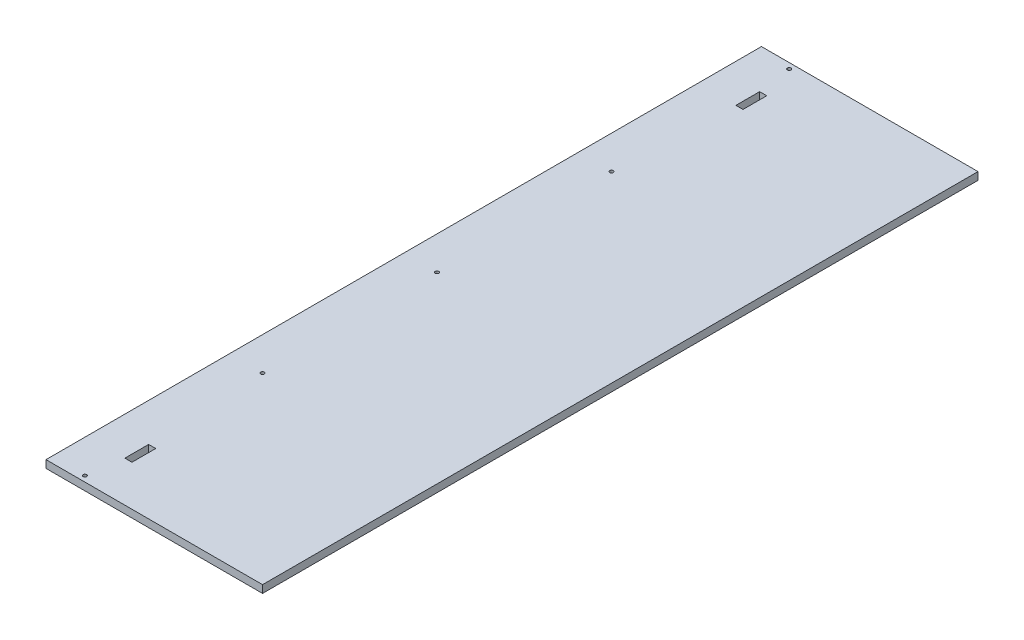
ISO-10303-21;
HEADER;
FILE_DESCRIPTION(('STEP AP214'),'2;1');
FILE_NAME('part.step','',(''),(''),'','','');
FILE_SCHEMA(('AUTOMOTIVE_DESIGN { 1 0 10303 214 1 1 1 1 }'));
ENDSEC;
DATA;
#1=APPLICATION_CONTEXT('core data for automotive mechanical design processes');
#2=APPLICATION_PROTOCOL_DEFINITION('international standard','automotive_design',2000,#1);
#3=PRODUCT_CONTEXT('',#1,'mechanical');
#4=PRODUCT('Part','Part','',(#3));
#5=PRODUCT_RELATED_PRODUCT_CATEGORY('part','',(#4));
#6=PRODUCT_DEFINITION_FORMATION('','',#4);
#7=PRODUCT_DEFINITION_CONTEXT('part definition',#1,'design');
#8=PRODUCT_DEFINITION('design','',#6,#7);
#9=PRODUCT_DEFINITION_SHAPE('','',#8);
#10=(LENGTH_UNIT() NAMED_UNIT(*) SI_UNIT(.MILLI.,.METRE.));
#11=(NAMED_UNIT(*) PLANE_ANGLE_UNIT() SI_UNIT($,.RADIAN.));
#12=(NAMED_UNIT(*) SI_UNIT($,.STERADIAN.) SOLID_ANGLE_UNIT());
#13=UNCERTAINTY_MEASURE_WITH_UNIT(LENGTH_MEASURE(1.E-05),#10,'distance_accuracy_value','');
#14=(GEOMETRIC_REPRESENTATION_CONTEXT(3) GLOBAL_UNCERTAINTY_ASSIGNED_CONTEXT((#13)) GLOBAL_UNIT_ASSIGNED_CONTEXT((#10,
#11,#12)) REPRESENTATION_CONTEXT('',''));
#15=CARTESIAN_POINT('',(0.,0.,0.));
#16=DIRECTION('',(0.,0.,1.));
#17=DIRECTION('',(1.,0.,0.));
#18=AXIS2_PLACEMENT_3D('',#15,#16,#17);
#19=CARTESIAN_POINT('',(-50.0000000000001,13.,-609.6));
#20=DIRECTION('',(0.,0.,1.));
#21=DIRECTION('',(1.,0.,0.));
#22=AXIS2_PLACEMENT_3D('',#19,#20,#21);
#23=PLANE('',#22);
#24=DIRECTION('',(0.,-1.,0.));
#25=VECTOR('',#24,1.);
#26=CARTESIAN_POINT('',(-50.0000000000001,13.,-609.6));
#27=LINE('',#26,#25);
#28=CARTESIAN_POINT('',(-50.0000000000001,13.,-609.6));
#29=VERTEX_POINT('',#28);
#30=CARTESIAN_POINT('',(-50.0000000000001,0.,-609.6));
#31=VERTEX_POINT('',#30);
#32=EDGE_CURVE('E217',#29,#31,#27,.T.);
#33=ORIENTED_EDGE('',*,*,#32,.F.);
#34=DIRECTION('',(-1.,0.,0.));
#35=VECTOR('',#34,1.);
#36=CARTESIAN_POINT('',(-50.0000000000001,13.,-609.6));
#37=LINE('',#36,#35);
#38=CARTESIAN_POINT('',(319.,13.,-609.6));
#39=VERTEX_POINT('',#38);
#40=EDGE_CURVE('E202',#39,#29,#37,.T.);
#41=ORIENTED_EDGE('',*,*,#40,.F.);
#42=DIRECTION('',(0.,-1.,0.));
#43=VECTOR('',#42,1.);
#44=CARTESIAN_POINT('',(319.,13.,-609.6));
#45=LINE('',#44,#43);
#46=CARTESIAN_POINT('',(319.,0.,-609.6));
#47=VERTEX_POINT('',#46);
#48=EDGE_CURVE('E171',#39,#47,#45,.T.);
#49=ORIENTED_EDGE('',*,*,#48,.T.);
#50=DIRECTION('',(-1.,0.,0.));
#51=VECTOR('',#50,1.);
#52=CARTESIAN_POINT('',(-50.0000000000001,0.,-609.6));
#53=LINE('',#52,#51);
#54=EDGE_CURVE('E210',#47,#31,#53,.T.);
#55=ORIENTED_EDGE('',*,*,#54,.T.);
#56=EDGE_LOOP('',(#33,#41,#49,#55));
#57=FACE_BOUND('',#56,.T.);
#58=ADVANCED_FACE('F34',(#57),#23,.F.);
#59=CARTESIAN_POINT('',(-50.0000000000001,13.,-609.6));
#60=DIRECTION('',(1.,0.,0.));
#61=DIRECTION('',(0.,0.,-1.));
#62=AXIS2_PLACEMENT_3D('',#59,#60,#61);
#63=PLANE('',#62);
#64=DIRECTION('',(0.,0.,1.));
#65=VECTOR('',#64,1.);
#66=CARTESIAN_POINT('',(-50.0000000000001,0.,-609.6));
#67=LINE('',#66,#65);
#68=CARTESIAN_POINT('',(-49.9999999999999,0.,609.6));
#69=VERTEX_POINT('',#68);
#70=EDGE_CURVE('E212',#31,#69,#67,.T.);
#71=ORIENTED_EDGE('',*,*,#70,.T.);
#72=DIRECTION('',(0.,-1.,0.));
#73=VECTOR('',#72,1.);
#74=CARTESIAN_POINT('',(-49.9999999999999,13.,609.6));
#75=LINE('',#74,#73);
#76=CARTESIAN_POINT('',(-49.9999999999999,13.,609.6));
#77=VERTEX_POINT('',#76);
#78=EDGE_CURVE('E209',#77,#69,#75,.T.);
#79=ORIENTED_EDGE('',*,*,#78,.F.);
#80=DIRECTION('',(0.,0.,1.));
#81=VECTOR('',#80,1.);
#82=CARTESIAN_POINT('',(-50.0000000000001,13.,-609.6));
#83=LINE('',#82,#81);
#84=EDGE_CURVE('E204',#29,#77,#83,.T.);
#85=ORIENTED_EDGE('',*,*,#84,.F.);
#86=ORIENTED_EDGE('',*,*,#32,.T.);
#87=EDGE_LOOP('',(#71,#79,#85,#86));
#88=FACE_BOUND('',#87,.T.);
#89=ADVANCED_FACE('F266',(#88),#63,.F.);
#90=CARTESIAN_POINT('',(-49.9999999999999,13.,609.6));
#91=DIRECTION('',(0.,0.,-1.));
#92=DIRECTION('',(-1.,0.,0.));
#93=AXIS2_PLACEMENT_3D('',#90,#91,#92);
#94=PLANE('',#93);
#95=DIRECTION('',(1.,0.,0.));
#96=VECTOR('',#95,1.);
#97=CARTESIAN_POINT('',(-49.9999999999999,0.,609.6));
#98=LINE('',#97,#96);
#99=CARTESIAN_POINT('',(319.,0.,609.6));
#100=VERTEX_POINT('',#99);
#101=EDGE_CURVE('E205',#69,#100,#98,.T.);
#102=ORIENTED_EDGE('',*,*,#101,.T.);
#103=DIRECTION('',(0.,1.,0.));
#104=VECTOR('',#103,1.);
#105=CARTESIAN_POINT('',(319.,13.,609.6));
#106=LINE('',#105,#104);
#107=CARTESIAN_POINT('',(319.,13.,609.6));
#108=VERTEX_POINT('',#107);
#109=EDGE_CURVE('E164',#100,#108,#106,.T.);
#110=ORIENTED_EDGE('',*,*,#109,.T.);
#111=DIRECTION('',(1.,0.,0.));
#112=VECTOR('',#111,1.);
#113=CARTESIAN_POINT('',(-49.9999999999999,13.,609.6));
#114=LINE('',#113,#112);
#115=EDGE_CURVE('E207',#77,#108,#114,.T.);
#116=ORIENTED_EDGE('',*,*,#115,.F.);
#117=ORIENTED_EDGE('',*,*,#78,.T.);
#118=EDGE_LOOP('',(#102,#110,#116,#117));
#119=FACE_BOUND('',#118,.T.);
#120=ADVANCED_FACE('F271',(#119),#94,.F.);
#121=CARTESIAN_POINT('',(50.0000000000001,13.,609.6));
#122=DIRECTION('',(0.,1.,0.));
#123=DIRECTION('',(0.,0.,1.));
#124=AXIS2_PLACEMENT_3D('',#121,#122,#123);
#125=PLANE('',#124);
#126=DIRECTION('',(0.,0.,1.));
#127=VECTOR('',#126,1.);
#128=CARTESIAN_POINT('',(14.9999999999997,13.,-541.53));
#129=LINE('',#128,#127);
#130=CARTESIAN_POINT('',(14.9999999999997,13.,-541.53));
#131=VERTEX_POINT('',#130);
#132=CARTESIAN_POINT('',(14.9999999999997,13.,-501.03));
#133=VERTEX_POINT('',#132);
#134=EDGE_CURVE('E48',#131,#133,#129,.T.);
#135=ORIENTED_EDGE('',*,*,#134,.F.);
#136=DIRECTION('',(-1.,0.,0.));
#137=VECTOR('',#136,1.);
#138=CARTESIAN_POINT('',(14.9999999999997,13.,-541.53));
#139=LINE('',#138,#137);
#140=CARTESIAN_POINT('',(27.0999999999997,13.,-541.53));
#141=VERTEX_POINT('',#140);
#142=EDGE_CURVE('E141',#141,#131,#139,.T.);
#143=ORIENTED_EDGE('',*,*,#142,.F.);
#144=DIRECTION('',(0.,0.,-1.));
#145=VECTOR('',#144,1.);
#146=CARTESIAN_POINT('',(27.0999999999997,13.,-541.53));
#147=LINE('',#146,#145);
#148=CARTESIAN_POINT('',(27.0999999999997,13.,-501.03));
#149=VERTEX_POINT('',#148);
#150=EDGE_CURVE('E125',#149,#141,#147,.T.);
#151=ORIENTED_EDGE('',*,*,#150,.F.);
#152=DIRECTION('',(1.,0.,0.));
#153=VECTOR('',#152,1.);
#154=CARTESIAN_POINT('',(14.9999999999997,13.,-501.03));
#155=LINE('',#154,#153);
#156=EDGE_CURVE('E134',#133,#149,#155,.T.);
#157=ORIENTED_EDGE('',*,*,#156,.F.);
#158=EDGE_LOOP('',(#135,#143,#151,#157));
#159=FACE_BOUND('',#158,.T.);
#160=DIRECTION('',(0.,0.,1.));
#161=VECTOR('',#160,1.);
#162=CARTESIAN_POINT('',(14.9999999999999,13.,499.72));
#163=LINE('',#162,#161);
#164=CARTESIAN_POINT('',(14.9999999999999,13.,499.72));
#165=VERTEX_POINT('',#164);
#166=CARTESIAN_POINT('',(14.9999999999999,13.,540.22));
#167=VERTEX_POINT('',#166);
#168=EDGE_CURVE('E148',#165,#167,#163,.T.);
#169=ORIENTED_EDGE('',*,*,#168,.F.);
#170=DIRECTION('',(-1.,0.,0.));
#171=VECTOR('',#170,1.);
#172=CARTESIAN_POINT('',(14.9999999999999,13.,499.72));
#173=LINE('',#172,#171);
#174=CARTESIAN_POINT('',(27.0999999999999,13.,499.72));
#175=VERTEX_POINT('',#174);
#176=EDGE_CURVE('E158',#175,#165,#173,.T.);
#177=ORIENTED_EDGE('',*,*,#176,.F.);
#178=DIRECTION('',(0.,0.,-1.));
#179=VECTOR('',#178,1.);
#180=CARTESIAN_POINT('',(27.0999999999999,13.,499.72));
#181=LINE('',#180,#179);
#182=CARTESIAN_POINT('',(27.0999999999999,13.,540.22));
#183=VERTEX_POINT('',#182);
#184=EDGE_CURVE('E155',#183,#175,#181,.T.);
#185=ORIENTED_EDGE('',*,*,#184,.F.);
#186=DIRECTION('',(1.,0.,0.));
#187=VECTOR('',#186,1.);
#188=CARTESIAN_POINT('',(14.9999999999999,13.,540.22));
#189=LINE('',#188,#187);
#190=EDGE_CURVE('E152',#167,#183,#189,.T.);
#191=ORIENTED_EDGE('',*,*,#190,.F.);
#192=EDGE_LOOP('',(#169,#177,#185,#191));
#193=FACE_BOUND('',#192,.T.);
#194=ORIENTED_EDGE('',*,*,#115,.T.);
#195=DIRECTION('',(0.,0.,1.));
#196=VECTOR('',#195,1.);
#197=CARTESIAN_POINT('',(319.,13.,-889.637672886696));
#198=LINE('',#197,#196);
#199=EDGE_CURVE('E175',#39,#108,#198,.T.);
#200=ORIENTED_EDGE('',*,*,#199,.F.);
#201=ORIENTED_EDGE('',*,*,#40,.T.);
#202=ORIENTED_EDGE('',*,*,#84,.T.);
#203=EDGE_LOOP('',(#194,#200,#201,#202));
#204=FACE_BOUND('',#203,.T.);
#205=CARTESIAN_POINT('',(6.74296906188358,13.,-600.1));
#206=DIRECTION('',(0.,1.,0.));
#207=DIRECTION('',(0.,0.,1.));
#208=AXIS2_PLACEMENT_3D('',#205,#206,#207);
#209=CIRCLE('',#208,3.);
#210=CARTESIAN_POINT('',(6.74296906188358,13.,-597.1));
#211=VERTEX_POINT('',#210);
#212=EDGE_CURVE('E174',#211,#211,#209,.T.);
#213=ORIENTED_EDGE('',*,*,#212,.F.);
#214=EDGE_LOOP('',(#213));
#215=FACE_BOUND('',#214,.T.);
#216=CARTESIAN_POINT('',(6.74296906188416,13.,-297.3));
#217=DIRECTION('',(0.,1.,0.));
#218=DIRECTION('',(0.,0.,1.));
#219=AXIS2_PLACEMENT_3D('',#216,#217,#218);
#220=CIRCLE('',#219,3.);
#221=CARTESIAN_POINT('',(6.74296906188416,13.,-294.3));
#222=VERTEX_POINT('',#221);
#223=EDGE_CURVE('E186',#222,#222,#220,.T.);
#224=ORIENTED_EDGE('',*,*,#223,.F.);
#225=EDGE_LOOP('',(#224));
#226=FACE_BOUND('',#225,.T.);
#227=CARTESIAN_POINT('',(6.74296906188408,13.,-2.22044604925031E-13));
#228=DIRECTION('',(0.,1.,0.));
#229=DIRECTION('',(0.,0.,1.));
#230=AXIS2_PLACEMENT_3D('',#227,#228,#229);
#231=CIRCLE('',#230,3.);
#232=CARTESIAN_POINT('',(6.74296906188408,13.,2.99999999999978));
#233=VERTEX_POINT('',#232);
#234=EDGE_CURVE('E190',#233,#233,#231,.T.);
#235=ORIENTED_EDGE('',*,*,#234,.F.);
#236=EDGE_LOOP('',(#235));
#237=FACE_BOUND('',#236,.T.);
#238=CARTESIAN_POINT('',(6.74296906188433,13.,297.3));
#239=DIRECTION('',(0.,1.,0.));
#240=DIRECTION('',(0.,0.,1.));
#241=AXIS2_PLACEMENT_3D('',#238,#239,#240);
#242=CIRCLE('',#241,3.);
#243=CARTESIAN_POINT('',(6.74296906188433,13.,300.3));
#244=VERTEX_POINT('',#243);
#245=EDGE_CURVE('E194',#244,#244,#242,.T.);
#246=ORIENTED_EDGE('',*,*,#245,.F.);
#247=EDGE_LOOP('',(#246));
#248=FACE_BOUND('',#247,.T.);
#249=CARTESIAN_POINT('',(6.74296906188521,13.,600.1));
#250=DIRECTION('',(0.,1.,0.));
#251=DIRECTION('',(0.,0.,1.));
#252=AXIS2_PLACEMENT_3D('',#249,#250,#251);
#253=CIRCLE('',#252,3.);
#254=CARTESIAN_POINT('',(6.74296906188521,13.,603.1));
#255=VERTEX_POINT('',#254);
#256=EDGE_CURVE('E198',#255,#255,#253,.T.);
#257=ORIENTED_EDGE('',*,*,#256,.F.);
#258=EDGE_LOOP('',(#257));
#259=FACE_BOUND('',#258,.T.);
#260=ADVANCED_FACE('F138',(#159,#193,#204,#215,#226,#237,#248,#259),#125,.T.);
#261=CARTESIAN_POINT('',(50.0000000000001,0.,609.6));
#262=DIRECTION('',(0.,1.,0.));
#263=DIRECTION('',(0.,0.,1.));
#264=AXIS2_PLACEMENT_3D('',#261,#262,#263);
#265=PLANE('',#264);
#266=DIRECTION('',(-1.,0.,0.));
#267=VECTOR('',#266,1.);
#268=CARTESIAN_POINT('',(50.0000000000001,0.,-541.53));
#269=LINE('',#268,#267);
#270=CARTESIAN_POINT('',(27.0999999999997,0.,-541.53));
#271=VERTEX_POINT('',#270);
#272=CARTESIAN_POINT('',(14.9999999999997,0.,-541.53));
#273=VERTEX_POINT('',#272);
#274=EDGE_CURVE('E41',#271,#273,#269,.T.);
#275=ORIENTED_EDGE('',*,*,#274,.T.);
#276=DIRECTION('',(0.,0.,1.));
#277=VECTOR('',#276,1.);
#278=CARTESIAN_POINT('',(14.9999999999999,0.,609.6));
#279=LINE('',#278,#277);
#280=CARTESIAN_POINT('',(14.9999999999997,0.,-501.03));
#281=VERTEX_POINT('',#280);
#282=EDGE_CURVE('E11',#273,#281,#279,.T.);
#283=ORIENTED_EDGE('',*,*,#282,.T.);
#284=DIRECTION('',(1.,0.,0.));
#285=VECTOR('',#284,1.);
#286=CARTESIAN_POINT('',(50.0000000000001,0.,-501.03));
#287=LINE('',#286,#285);
#288=CARTESIAN_POINT('',(27.0999999999997,0.,-501.03));
#289=VERTEX_POINT('',#288);
#290=EDGE_CURVE('E242',#281,#289,#287,.T.);
#291=ORIENTED_EDGE('',*,*,#290,.T.);
#292=DIRECTION('',(0.,0.,-1.));
#293=VECTOR('',#292,1.);
#294=CARTESIAN_POINT('',(27.0999999999999,0.,609.6));
#295=LINE('',#294,#293);
#296=EDGE_CURVE('E128',#289,#271,#295,.T.);
#297=ORIENTED_EDGE('',*,*,#296,.T.);
#298=EDGE_LOOP('',(#275,#283,#291,#297));
#299=FACE_BOUND('',#298,.T.);
#300=DIRECTION('',(-1.,0.,0.));
#301=VECTOR('',#300,1.);
#302=CARTESIAN_POINT('',(50.0000000000001,0.,499.72));
#303=LINE('',#302,#301);
#304=CARTESIAN_POINT('',(27.0999999999999,0.,499.72));
#305=VERTEX_POINT('',#304);
#306=CARTESIAN_POINT('',(14.9999999999999,0.,499.72));
#307=VERTEX_POINT('',#306);
#308=EDGE_CURVE('E236',#305,#307,#303,.T.);
#309=ORIENTED_EDGE('',*,*,#308,.T.);
#310=DIRECTION('',(0.,0.,1.));
#311=VECTOR('',#310,1.);
#312=CARTESIAN_POINT('',(15.,0.,609.6));
#313=LINE('',#312,#311);
#314=CARTESIAN_POINT('',(14.9999999999999,0.,540.22));
#315=VERTEX_POINT('',#314);
#316=EDGE_CURVE('E239',#307,#315,#313,.T.);
#317=ORIENTED_EDGE('',*,*,#316,.T.);
#318=DIRECTION('',(1.,0.,0.));
#319=VECTOR('',#318,1.);
#320=CARTESIAN_POINT('',(50.0000000000001,0.,540.22));
#321=LINE('',#320,#319);
#322=CARTESIAN_POINT('',(27.0999999999999,0.,540.22));
#323=VERTEX_POINT('',#322);
#324=EDGE_CURVE('E220',#315,#323,#321,.T.);
#325=ORIENTED_EDGE('',*,*,#324,.T.);
#326=DIRECTION('',(0.,0.,-1.));
#327=VECTOR('',#326,1.);
#328=CARTESIAN_POINT('',(27.0999999999999,0.,609.6));
#329=LINE('',#328,#327);
#330=EDGE_CURVE('E233',#323,#305,#329,.T.);
#331=ORIENTED_EDGE('',*,*,#330,.T.);
#332=EDGE_LOOP('',(#309,#317,#325,#331));
#333=FACE_BOUND('',#332,.T.);
#334=CARTESIAN_POINT('',(6.74296906188358,0.,-600.1));
#335=DIRECTION('',(0.,1.,0.));
#336=DIRECTION('',(0.,0.,1.));
#337=AXIS2_PLACEMENT_3D('',#334,#335,#336);
#338=CIRCLE('',#337,3.);
#339=CARTESIAN_POINT('',(6.74296906188358,0.,-597.1));
#340=VERTEX_POINT('',#339);
#341=EDGE_CURVE('E185',#340,#340,#338,.T.);
#342=ORIENTED_EDGE('',*,*,#341,.T.);
#343=EDGE_LOOP('',(#342));
#344=FACE_BOUND('',#343,.T.);
#345=CARTESIAN_POINT('',(6.74296906188416,0.,-297.3));
#346=DIRECTION('',(0.,1.,0.));
#347=DIRECTION('',(0.,0.,1.));
#348=AXIS2_PLACEMENT_3D('',#345,#346,#347);
#349=CIRCLE('',#348,3.);
#350=CARTESIAN_POINT('',(6.74296906188416,0.,-294.3));
#351=VERTEX_POINT('',#350);
#352=EDGE_CURVE('E189',#351,#351,#349,.T.);
#353=ORIENTED_EDGE('',*,*,#352,.T.);
#354=EDGE_LOOP('',(#353));
#355=FACE_BOUND('',#354,.T.);
#356=CARTESIAN_POINT('',(6.74296906188408,0.,-2.22044604925031E-13));
#357=DIRECTION('',(0.,1.,0.));
#358=DIRECTION('',(0.,0.,1.));
#359=AXIS2_PLACEMENT_3D('',#356,#357,#358);
#360=CIRCLE('',#359,3.);
#361=CARTESIAN_POINT('',(6.74296906188408,0.,2.99999999999978));
#362=VERTEX_POINT('',#361);
#363=EDGE_CURVE('E193',#362,#362,#360,.T.);
#364=ORIENTED_EDGE('',*,*,#363,.T.);
#365=EDGE_LOOP('',(#364));
#366=FACE_BOUND('',#365,.T.);
#367=CARTESIAN_POINT('',(6.74296906188433,0.,297.3));
#368=DIRECTION('',(0.,1.,0.));
#369=DIRECTION('',(0.,0.,1.));
#370=AXIS2_PLACEMENT_3D('',#367,#368,#369);
#371=CIRCLE('',#370,3.);
#372=CARTESIAN_POINT('',(6.74296906188433,0.,300.3));
#373=VERTEX_POINT('',#372);
#374=EDGE_CURVE('E197',#373,#373,#371,.T.);
#375=ORIENTED_EDGE('',*,*,#374,.T.);
#376=EDGE_LOOP('',(#375));
#377=FACE_BOUND('',#376,.T.);
#378=CARTESIAN_POINT('',(6.74296906188521,0.,600.1));
#379=DIRECTION('',(0.,1.,0.));
#380=DIRECTION('',(0.,0.,1.));
#381=AXIS2_PLACEMENT_3D('',#378,#379,#380);
#382=CIRCLE('',#381,3.);
#383=CARTESIAN_POINT('',(6.74296906188521,0.,603.1));
#384=VERTEX_POINT('',#383);
#385=EDGE_CURVE('E201',#384,#384,#382,.T.);
#386=ORIENTED_EDGE('',*,*,#385,.T.);
#387=EDGE_LOOP('',(#386));
#388=FACE_BOUND('',#387,.T.);
#389=ORIENTED_EDGE('',*,*,#70,.F.);
#390=ORIENTED_EDGE('',*,*,#54,.F.);
#391=DIRECTION('',(0.,0.,1.));
#392=VECTOR('',#391,1.);
#393=CARTESIAN_POINT('',(319.,0.,-889.637672886696));
#394=LINE('',#393,#392);
#395=EDGE_CURVE('E178',#47,#100,#394,.T.);
#396=ORIENTED_EDGE('',*,*,#395,.T.);
#397=ORIENTED_EDGE('',*,*,#101,.F.);
#398=EDGE_LOOP('',(#389,#390,#396,#397));
#399=FACE_BOUND('',#398,.T.);
#400=ADVANCED_FACE('F246',(#299,#333,#344,#355,#366,#377,#388,#399),#265,.F.);
#401=CARTESIAN_POINT('',(6.74296906188521,-7.,600.1));
#402=DIRECTION('',(0.,1.,0.));
#403=DIRECTION('',(0.,0.,1.));
#404=AXIS2_PLACEMENT_3D('',#401,#402,#403);
#405=CYLINDRICAL_SURFACE('',#404,3.);
#406=ORIENTED_EDGE('',*,*,#256,.T.);
#407=EDGE_LOOP('',(#406));
#408=FACE_BOUND('',#407,.T.);
#409=ORIENTED_EDGE('',*,*,#385,.F.);
#410=EDGE_LOOP('',(#409));
#411=FACE_BOUND('',#410,.T.);
#412=ADVANCED_FACE('F290',(#408,#411),#405,.F.);
#413=CARTESIAN_POINT('',(6.74296906188433,-7.,297.3));
#414=DIRECTION('',(0.,1.,0.));
#415=DIRECTION('',(0.,0.,1.));
#416=AXIS2_PLACEMENT_3D('',#413,#414,#415);
#417=CYLINDRICAL_SURFACE('',#416,3.);
#418=ORIENTED_EDGE('',*,*,#245,.T.);
#419=EDGE_LOOP('',(#418));
#420=FACE_BOUND('',#419,.T.);
#421=ORIENTED_EDGE('',*,*,#374,.F.);
#422=EDGE_LOOP('',(#421));
#423=FACE_BOUND('',#422,.T.);
#424=ADVANCED_FACE('F297',(#420,#423),#417,.F.);
#425=CARTESIAN_POINT('',(6.74296906188408,-7.,-2.22044604925031E-13));
#426=DIRECTION('',(0.,1.,0.));
#427=DIRECTION('',(0.,0.,1.));
#428=AXIS2_PLACEMENT_3D('',#425,#426,#427);
#429=CYLINDRICAL_SURFACE('',#428,3.);
#430=ORIENTED_EDGE('',*,*,#234,.T.);
#431=EDGE_LOOP('',(#430));
#432=FACE_BOUND('',#431,.T.);
#433=ORIENTED_EDGE('',*,*,#363,.F.);
#434=EDGE_LOOP('',(#433));
#435=FACE_BOUND('',#434,.T.);
#436=ADVANCED_FACE('F331',(#432,#435),#429,.F.);
#437=CARTESIAN_POINT('',(6.74296906188416,-7.,-297.3));
#438=DIRECTION('',(0.,1.,0.));
#439=DIRECTION('',(0.,0.,1.));
#440=AXIS2_PLACEMENT_3D('',#437,#438,#439);
#441=CYLINDRICAL_SURFACE('',#440,3.);
#442=ORIENTED_EDGE('',*,*,#223,.T.);
#443=EDGE_LOOP('',(#442));
#444=FACE_BOUND('',#443,.T.);
#445=ORIENTED_EDGE('',*,*,#352,.F.);
#446=EDGE_LOOP('',(#445));
#447=FACE_BOUND('',#446,.T.);
#448=ADVANCED_FACE('F339',(#444,#447),#441,.F.);
#449=CARTESIAN_POINT('',(6.74296906188358,-7.,-600.1));
#450=DIRECTION('',(0.,1.,0.));
#451=DIRECTION('',(0.,0.,1.));
#452=AXIS2_PLACEMENT_3D('',#449,#450,#451);
#453=CYLINDRICAL_SURFACE('',#452,3.);
#454=ORIENTED_EDGE('',*,*,#212,.T.);
#455=EDGE_LOOP('',(#454));
#456=FACE_BOUND('',#455,.T.);
#457=ORIENTED_EDGE('',*,*,#341,.F.);
#458=EDGE_LOOP('',(#457));
#459=FACE_BOUND('',#458,.T.);
#460=ADVANCED_FACE('F347',(#456,#459),#453,.F.);
#461=CARTESIAN_POINT('',(319.,13.,-889.637672886696));
#462=DIRECTION('',(1.,0.,0.));
#463=DIRECTION('',(0.,0.,-1.));
#464=AXIS2_PLACEMENT_3D('',#461,#462,#463);
#465=PLANE('',#464);
#466=ORIENTED_EDGE('',*,*,#48,.F.);
#467=ORIENTED_EDGE('',*,*,#199,.T.);
#468=ORIENTED_EDGE('',*,*,#109,.F.);
#469=ORIENTED_EDGE('',*,*,#395,.F.);
#470=EDGE_LOOP('',(#466,#467,#468,#469));
#471=FACE_BOUND('',#470,.T.);
#472=ADVANCED_FACE('F284',(#471),#465,.T.);
#473=CARTESIAN_POINT('',(14.9999999999999,-7.,499.72));
#474=DIRECTION('',(-1.,0.,0.));
#475=DIRECTION('',(0.,0.,1.));
#476=AXIS2_PLACEMENT_3D('',#473,#474,#475);
#477=PLANE('',#476);
#478=DIRECTION('',(0.,1.,0.));
#479=VECTOR('',#478,1.);
#480=CARTESIAN_POINT('',(14.9999999999999,-7.,499.72));
#481=LINE('',#480,#479);
#482=EDGE_CURVE('E162',#307,#165,#481,.T.);
#483=ORIENTED_EDGE('',*,*,#482,.T.);
#484=ORIENTED_EDGE('',*,*,#168,.T.);
#485=DIRECTION('',(0.,1.,0.));
#486=VECTOR('',#485,1.);
#487=CARTESIAN_POINT('',(14.9999999999999,-7.,540.22));
#488=LINE('',#487,#486);
#489=EDGE_CURVE('E161',#315,#167,#488,.T.);
#490=ORIENTED_EDGE('',*,*,#489,.F.);
#491=ORIENTED_EDGE('',*,*,#316,.F.);
#492=EDGE_LOOP('',(#483,#484,#490,#491));
#493=FACE_BOUND('',#492,.T.);
#494=ADVANCED_FACE('F361',(#493),#477,.F.);
#495=CARTESIAN_POINT('',(14.9999999999999,-7.,499.72));
#496=DIRECTION('',(0.,0.,-1.));
#497=DIRECTION('',(-1.,0.,0.));
#498=AXIS2_PLACEMENT_3D('',#495,#496,#497);
#499=PLANE('',#498);
#500=DIRECTION('',(0.,1.,0.));
#501=VECTOR('',#500,1.);
#502=CARTESIAN_POINT('',(27.0999999999999,-7.,499.72));
#503=LINE('',#502,#501);
#504=EDGE_CURVE('E165',#305,#175,#503,.T.);
#505=ORIENTED_EDGE('',*,*,#504,.T.);
#506=ORIENTED_EDGE('',*,*,#176,.T.);
#507=ORIENTED_EDGE('',*,*,#482,.F.);
#508=ORIENTED_EDGE('',*,*,#308,.F.);
#509=EDGE_LOOP('',(#505,#506,#507,#508));
#510=FACE_BOUND('',#509,.T.);
#511=ADVANCED_FACE('F366',(#510),#499,.F.);
#512=CARTESIAN_POINT('',(27.0999999999999,-7.,499.72));
#513=DIRECTION('',(1.,0.,0.));
#514=DIRECTION('',(0.,0.,-1.));
#515=AXIS2_PLACEMENT_3D('',#512,#513,#514);
#516=PLANE('',#515);
#517=DIRECTION('',(0.,1.,0.));
#518=VECTOR('',#517,1.);
#519=CARTESIAN_POINT('',(27.0999999999999,-7.,540.22));
#520=LINE('',#519,#518);
#521=EDGE_CURVE('E167',#323,#183,#520,.T.);
#522=ORIENTED_EDGE('',*,*,#521,.T.);
#523=ORIENTED_EDGE('',*,*,#184,.T.);
#524=ORIENTED_EDGE('',*,*,#504,.F.);
#525=ORIENTED_EDGE('',*,*,#330,.F.);
#526=EDGE_LOOP('',(#522,#523,#524,#525));
#527=FACE_BOUND('',#526,.T.);
#528=ADVANCED_FACE('F260',(#527),#516,.F.);
#529=CARTESIAN_POINT('',(14.9999999999999,-7.,540.22));
#530=DIRECTION('',(0.,0.,1.));
#531=DIRECTION('',(1.,0.,0.));
#532=AXIS2_PLACEMENT_3D('',#529,#530,#531);
#533=PLANE('',#532);
#534=ORIENTED_EDGE('',*,*,#489,.T.);
#535=ORIENTED_EDGE('',*,*,#190,.T.);
#536=ORIENTED_EDGE('',*,*,#521,.F.);
#537=ORIENTED_EDGE('',*,*,#324,.F.);
#538=EDGE_LOOP('',(#534,#535,#536,#537));
#539=FACE_BOUND('',#538,.T.);
#540=ADVANCED_FACE('F253',(#539),#533,.F.);
#541=CARTESIAN_POINT('',(14.9999999999997,-7.,-541.53));
#542=DIRECTION('',(-1.,0.,0.));
#543=DIRECTION('',(0.,0.,1.));
#544=AXIS2_PLACEMENT_3D('',#541,#542,#543);
#545=PLANE('',#544);
#546=DIRECTION('',(0.,1.,0.));
#547=VECTOR('',#546,1.);
#548=CARTESIAN_POINT('',(14.9999999999997,-7.,-541.53));
#549=LINE('',#548,#547);
#550=EDGE_CURVE('E146',#273,#131,#549,.T.);
#551=ORIENTED_EDGE('',*,*,#550,.T.);
#552=ORIENTED_EDGE('',*,*,#134,.T.);
#553=DIRECTION('',(0.,1.,0.));
#554=VECTOR('',#553,1.);
#555=CARTESIAN_POINT('',(14.9999999999997,-7.,-501.03));
#556=LINE('',#555,#554);
#557=EDGE_CURVE('E131',#281,#133,#556,.T.);
#558=ORIENTED_EDGE('',*,*,#557,.F.);
#559=ORIENTED_EDGE('',*,*,#282,.F.);
#560=EDGE_LOOP('',(#551,#552,#558,#559));
#561=FACE_BOUND('',#560,.T.);
#562=ADVANCED_FACE('F251',(#561),#545,.F.);
#563=CARTESIAN_POINT('',(14.9999999999997,-7.,-541.53));
#564=DIRECTION('',(0.,0.,-1.));
#565=DIRECTION('',(-1.,0.,0.));
#566=AXIS2_PLACEMENT_3D('',#563,#564,#565);
#567=PLANE('',#566);
#568=DIRECTION('',(0.,1.,0.));
#569=VECTOR('',#568,1.);
#570=CARTESIAN_POINT('',(27.0999999999997,-7.,-541.53));
#571=LINE('',#570,#569);
#572=EDGE_CURVE('E130',#271,#141,#571,.T.);
#573=ORIENTED_EDGE('',*,*,#572,.T.);
#574=ORIENTED_EDGE('',*,*,#142,.T.);
#575=ORIENTED_EDGE('',*,*,#550,.F.);
#576=ORIENTED_EDGE('',*,*,#274,.F.);
#577=EDGE_LOOP('',(#573,#574,#575,#576));
#578=FACE_BOUND('',#577,.T.);
#579=ADVANCED_FACE('F250',(#578),#567,.F.);
#580=CARTESIAN_POINT('',(27.0999999999997,-7.,-541.53));
#581=DIRECTION('',(1.,0.,0.));
#582=DIRECTION('',(0.,0.,-1.));
#583=AXIS2_PLACEMENT_3D('',#580,#581,#582);
#584=PLANE('',#583);
#585=DIRECTION('',(0.,1.,0.));
#586=VECTOR('',#585,1.);
#587=CARTESIAN_POINT('',(27.0999999999997,-7.,-501.03));
#588=LINE('',#587,#586);
#589=EDGE_CURVE('E56',#289,#149,#588,.T.);
#590=ORIENTED_EDGE('',*,*,#589,.T.);
#591=ORIENTED_EDGE('',*,*,#150,.T.);
#592=ORIENTED_EDGE('',*,*,#572,.F.);
#593=ORIENTED_EDGE('',*,*,#296,.F.);
#594=EDGE_LOOP('',(#590,#591,#592,#593));
#595=FACE_BOUND('',#594,.T.);
#596=ADVANCED_FACE('F122',(#595),#584,.F.);
#597=CARTESIAN_POINT('',(14.9999999999997,-7.,-501.03));
#598=DIRECTION('',(0.,0.,1.));
#599=DIRECTION('',(1.,0.,0.));
#600=AXIS2_PLACEMENT_3D('',#597,#598,#599);
#601=PLANE('',#600);
#602=ORIENTED_EDGE('',*,*,#557,.T.);
#603=ORIENTED_EDGE('',*,*,#156,.T.);
#604=ORIENTED_EDGE('',*,*,#589,.F.);
#605=ORIENTED_EDGE('',*,*,#290,.F.);
#606=EDGE_LOOP('',(#602,#603,#604,#605));
#607=FACE_BOUND('',#606,.T.);
#608=ADVANCED_FACE('F135',(#607),#601,.F.);
#609=CLOSED_SHELL('',(#58,#89,#120,#260,#400,#412,#424,#436,#448,#460,#472,#494,#511,#528,#540,
#562,#579,#596,#608));
#610=MANIFOLD_SOLID_BREP('B2',#609);
#611=ADVANCED_BREP_SHAPE_REPRESENTATION('',(#18,#610),#14);
#612=SHAPE_DEFINITION_REPRESENTATION(#9,#611);
ENDSEC;
END-ISO-10303-21;
